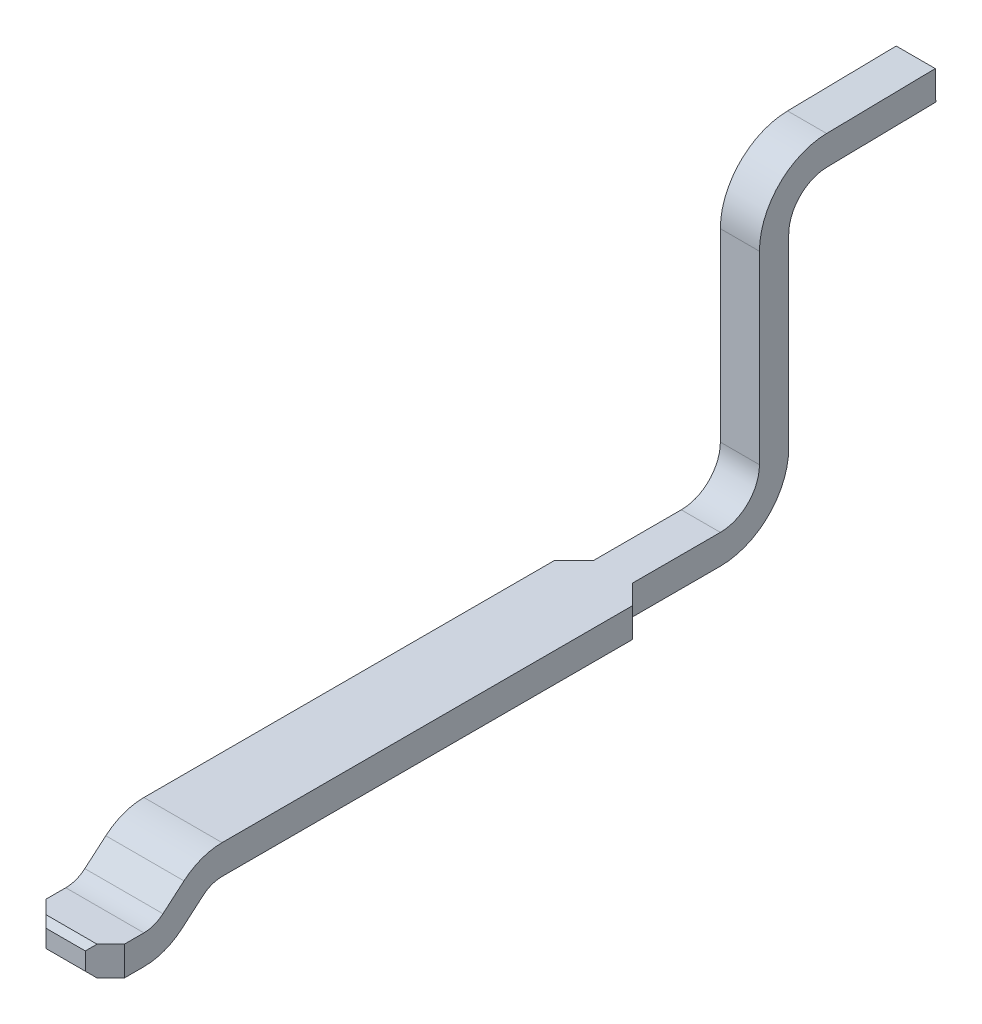
ISO-10303-21;
HEADER;
FILE_DESCRIPTION(('STEP AP214'),'2;1');
FILE_NAME('part.step','',(''),(''),'','','');
FILE_SCHEMA(('AUTOMOTIVE_DESIGN { 1 0 10303 214 1 1 1 1 }'));
ENDSEC;
DATA;
#1=APPLICATION_CONTEXT('core data for automotive mechanical design processes');
#2=APPLICATION_PROTOCOL_DEFINITION('international standard','automotive_design',2000,#1);
#3=PRODUCT_CONTEXT('',#1,'mechanical');
#4=PRODUCT('Part','Part','',(#3));
#5=PRODUCT_RELATED_PRODUCT_CATEGORY('part','',(#4));
#6=PRODUCT_DEFINITION_FORMATION('','',#4);
#7=PRODUCT_DEFINITION_CONTEXT('part definition',#1,'design');
#8=PRODUCT_DEFINITION('design','',#6,#7);
#9=PRODUCT_DEFINITION_SHAPE('','',#8);
#10=(LENGTH_UNIT() NAMED_UNIT(*) SI_UNIT(.MILLI.,.METRE.));
#11=(NAMED_UNIT(*) PLANE_ANGLE_UNIT() SI_UNIT($,.RADIAN.));
#12=(NAMED_UNIT(*) SI_UNIT($,.STERADIAN.) SOLID_ANGLE_UNIT());
#13=UNCERTAINTY_MEASURE_WITH_UNIT(LENGTH_MEASURE(1.E-05),#10,'distance_accuracy_value','');
#14=(GEOMETRIC_REPRESENTATION_CONTEXT(3) GLOBAL_UNCERTAINTY_ASSIGNED_CONTEXT((#13)) GLOBAL_UNIT_ASSIGNED_CONTEXT((#10,
#11,#12)) REPRESENTATION_CONTEXT('',''));
#15=CARTESIAN_POINT('',(0.,0.,0.));
#16=DIRECTION('',(0.,0.,1.));
#17=DIRECTION('',(1.,0.,0.));
#18=AXIS2_PLACEMENT_3D('',#15,#16,#17);
#19=CARTESIAN_POINT('',(1.85403496496787,8.074228109921,4.324047830079));
#20=DIRECTION('',(0.,0.707106781186548,0.707106781186548));
#21=DIRECTION('',(0.,-0.707106781186548,0.707106781186548));
#22=AXIS2_PLACEMENT_3D('',#19,#20,#21);
#23=PLANE('',#22);
#24=DIRECTION('',(-0.577350269189631,0.577350269189615,-0.577350269189631));
#25=VECTOR('',#24,1.);
#26=CARTESIAN_POINT('',(1.88973309999987,8.04019892,4.35807702));
#27=LINE('',#26,#25);
#28=CARTESIAN_POINT('',(1.88973309999987,8.04019892,4.35807702));
#29=VERTEX_POINT('',#28);
#30=CARTESIAN_POINT('',(1.85973309999987,8.07019892,4.32807702));
#31=VERTEX_POINT('',#30);
#32=EDGE_CURVE('E186',#29,#31,#27,.T.);
#33=ORIENTED_EDGE('',*,*,#32,.F.);
#34=DIRECTION('',(-1.,0.,0.));
#35=VECTOR('',#34,1.);
#36=CARTESIAN_POINT('',(2.09543123503187,8.04019892,4.35807702));
#37=LINE('',#36,#35);
#38=CARTESIAN_POINT('',(2.08973309999987,8.04019892,4.35807702));
#39=VERTEX_POINT('',#38);
#40=EDGE_CURVE('E179',#29,#39,#37,.F.);
#41=ORIENTED_EDGE('',*,*,#40,.T.);
#42=DIRECTION('',(-0.577350269189637,-0.577350269189604,0.577350269189637));
#43=VECTOR('',#42,1.);
#44=CARTESIAN_POINT('',(2.11973309999987,8.07019892,4.32807702));
#45=LINE('',#44,#43);
#46=CARTESIAN_POINT('',(2.11973309999987,8.07019892,4.32807702));
#47=VERTEX_POINT('',#46);
#48=EDGE_CURVE('E302',#47,#39,#45,.T.);
#49=ORIENTED_EDGE('',*,*,#48,.F.);
#50=DIRECTION('',(1.,0.,0.));
#51=VECTOR('',#50,1.);
#52=CARTESIAN_POINT('',(2.19773309999987,8.07019892,4.32807702));
#53=LINE('',#52,#51);
#54=EDGE_CURVE('E309',#31,#47,#53,.T.);
#55=ORIENTED_EDGE('',*,*,#54,.F.);
#56=EDGE_LOOP('',(#33,#41,#49,#55));
#57=FACE_BOUND('',#56,.T.);
#58=ADVANCED_FACE('F17',(#57),#23,.T.);
#59=CARTESIAN_POINT('',(2.09543123503187,7.944500784968,4.35807702));
#60=DIRECTION('',(0.,0.,-1.));
#61=DIRECTION('',(-1.,0.,0.));
#62=AXIS2_PLACEMENT_3D('',#59,#60,#61);
#63=PLANE('',#62);
#64=DIRECTION('',(0.,1.,0.));
#65=VECTOR('',#64,1.);
#66=CARTESIAN_POINT('',(2.08973309999987,7.914500784968,4.35807702));
#67=LINE('',#66,#65);
#68=CARTESIAN_POINT('',(2.08973309999987,7.95019892,4.35807702));
#69=VERTEX_POINT('',#68);
#70=EDGE_CURVE('E289',#39,#69,#67,.F.);
#71=ORIENTED_EDGE('',*,*,#70,.F.);
#72=ORIENTED_EDGE('',*,*,#40,.F.);
#73=DIRECTION('',(0.,1.,0.));
#74=VECTOR('',#73,1.);
#75=CARTESIAN_POINT('',(1.88973309999987,7.914500784968,4.35807702));
#76=LINE('',#75,#74);
#77=CARTESIAN_POINT('',(1.88973309999987,7.95019892,4.35807702));
#78=VERTEX_POINT('',#77);
#79=EDGE_CURVE('E368',#78,#29,#76,.T.);
#80=ORIENTED_EDGE('',*,*,#79,.F.);
#81=DIRECTION('',(1.,0.,0.));
#82=VECTOR('',#81,1.);
#83=CARTESIAN_POINT('',(2.12543123503187,7.95019892,4.35807702));
#84=LINE('',#83,#82);
#85=EDGE_CURVE('E359',#69,#78,#84,.F.);
#86=ORIENTED_EDGE('',*,*,#85,.F.);
#87=EDGE_LOOP('',(#71,#72,#80,#86));
#88=FACE_BOUND('',#87,.T.);
#89=ADVANCED_FACE('F778',(#88),#63,.F.);
#90=CARTESIAN_POINT('',(2.12543123503187,7.916169730079,4.324047830079));
#91=DIRECTION('',(0.,-0.707106781186548,0.707106781186548));
#92=DIRECTION('',(0.,-0.707106781186548,-0.707106781186548));
#93=AXIS2_PLACEMENT_3D('',#90,#91,#92);
#94=PLANE('',#93);
#95=DIRECTION('',(0.577350269189626,-0.577350269189626,-0.577350269189626));
#96=VECTOR('',#95,1.);
#97=CARTESIAN_POINT('',(2.08973309999987,7.95019892,4.35807702));
#98=LINE('',#97,#96);
#99=CARTESIAN_POINT('',(2.11973309999987,7.92019892,4.32807702));
#100=VERTEX_POINT('',#99);
#101=EDGE_CURVE('E303',#69,#100,#98,.T.);
#102=ORIENTED_EDGE('',*,*,#101,.F.);
#103=ORIENTED_EDGE('',*,*,#85,.T.);
#104=DIRECTION('',(0.57735026918962,0.577350269189637,0.57735026918962));
#105=VECTOR('',#104,1.);
#106=CARTESIAN_POINT('',(1.85973309999987,7.92019892,4.32807702));
#107=LINE('',#106,#105);
#108=CARTESIAN_POINT('',(1.85973309999987,7.92019892,4.32807702));
#109=VERTEX_POINT('',#108);
#110=EDGE_CURVE('E344',#109,#78,#107,.T.);
#111=ORIENTED_EDGE('',*,*,#110,.F.);
#112=DIRECTION('',(1.,0.,0.));
#113=VECTOR('',#112,1.);
#114=CARTESIAN_POINT('',(2.19773309999987,7.92019892,4.32807702));
#115=LINE('',#114,#113);
#116=EDGE_CURVE('E284',#109,#100,#115,.T.);
#117=ORIENTED_EDGE('',*,*,#116,.T.);
#118=EDGE_LOOP('',(#102,#103,#111,#117));
#119=FACE_BOUND('',#118,.T.);
#120=ADVANCED_FACE('F771',(#119),#94,.T.);
#121=CARTESIAN_POINT('',(2.09543123503187,8.45127780084181,0.758077020000001));
#122=DIRECTION('',(0.,0.,-1.));
#123=DIRECTION('',(-1.,0.,0.));
#124=AXIS2_PLACEMENT_3D('',#121,#122,#123);
#125=PLANE('',#124);
#126=DIRECTION('',(0.,1.,0.));
#127=VECTOR('',#126,1.);
#128=CARTESIAN_POINT('',(2.08973309999987,9.610333059471,0.758077020000001));
#129=LINE('',#128,#127);
#130=CARTESIAN_POINT('',(2.08973309999987,8.47019892,0.758077020000001));
#131=VERTEX_POINT('',#130);
#132=CARTESIAN_POINT('',(2.08973309999987,9.41625487791,0.758077020000001));
#133=VERTEX_POINT('',#132);
#134=EDGE_CURVE('E253',#131,#133,#129,.T.);
#135=ORIENTED_EDGE('',*,*,#134,.F.);
#136=DIRECTION('',(-1.,0.,0.));
#137=VECTOR('',#136,1.);
#138=CARTESIAN_POINT('',(2.08973309999987,8.47019892,0.75807702));
#139=LINE('',#138,#137);
#140=CARTESIAN_POINT('',(1.88973309999987,8.47019892,0.758077020000001));
#141=VERTEX_POINT('',#140);
#142=EDGE_CURVE('E361',#141,#131,#139,.F.);
#143=ORIENTED_EDGE('',*,*,#142,.F.);
#144=DIRECTION('',(0.,1.,0.));
#145=VECTOR('',#144,1.);
#146=CARTESIAN_POINT('',(1.88973309999987,8.45127780084181,0.758077020000001));
#147=LINE('',#146,#145);
#148=CARTESIAN_POINT('',(1.88973309999987,9.41625487791,0.758077020000001));
#149=VERTEX_POINT('',#148);
#150=EDGE_CURVE('E235',#149,#141,#147,.F.);
#151=ORIENTED_EDGE('',*,*,#150,.F.);
#152=DIRECTION('',(1.,0.,0.));
#153=VECTOR('',#152,1.);
#154=CARTESIAN_POINT('',(1.88973309999987,9.41625487791,0.758077020000001));
#155=LINE('',#154,#153);
#156=EDGE_CURVE('E342',#149,#133,#155,.T.);
#157=ORIENTED_EDGE('',*,*,#156,.T.);
#158=EDGE_LOOP('',(#135,#143,#151,#157));
#159=FACE_BOUND('',#158,.T.);
#160=ADVANCED_FACE('F474',(#159),#125,.T.);
#161=CARTESIAN_POINT('',(2.08973309999987,8.47019892,1.10807702));
#162=DIRECTION('',(-1.,0.,0.));
#163=DIRECTION('',(0.,0.,1.));
#164=AXIS2_PLACEMENT_3D('',#161,#162,#163);
#165=CYLINDRICAL_SURFACE('',#164,0.2);
#166=DIRECTION('',(1.,0.,0.));
#167=VECTOR('',#166,1.);
#168=CARTESIAN_POINT('',(2.19773309999987,8.27019892,1.10807702));
#169=LINE('',#168,#167);
#170=CARTESIAN_POINT('',(2.08973309999987,8.27019892,1.10807702));
#171=VERTEX_POINT('',#170);
#172=CARTESIAN_POINT('',(1.88973309999987,8.27019892,1.10807702));
#173=VERTEX_POINT('',#172);
#174=EDGE_CURVE('E317',#171,#173,#169,.F.);
#175=ORIENTED_EDGE('',*,*,#174,.F.);
#176=CARTESIAN_POINT('',(2.08973309999987,8.47019892,1.10807702));
#177=DIRECTION('',(-1.,0.,0.));
#178=DIRECTION('',(0.,0.,1.));
#179=AXIS2_PLACEMENT_3D('',#176,#177,#178);
#180=CIRCLE('',#179,0.2);
#181=CARTESIAN_POINT('',(2.08973309999987,8.47019892,0.908077020000001));
#182=VERTEX_POINT('',#181);
#183=EDGE_CURVE('E259',#182,#171,#180,.T.);
#184=ORIENTED_EDGE('',*,*,#183,.F.);
#185=DIRECTION('',(-1.,0.,0.));
#186=VECTOR('',#185,1.);
#187=CARTESIAN_POINT('',(2.09543123503187,8.47019892,0.908077020000001));
#188=LINE('',#187,#186);
#189=CARTESIAN_POINT('',(1.88973309999987,8.47019892,0.908077020000001));
#190=VERTEX_POINT('',#189);
#191=EDGE_CURVE('E356',#182,#190,#188,.T.);
#192=ORIENTED_EDGE('',*,*,#191,.T.);
#193=CARTESIAN_POINT('',(1.88973309999987,8.47019892,1.10807702));
#194=DIRECTION('',(-1.,0.,0.));
#195=DIRECTION('',(0.,0.,1.));
#196=AXIS2_PLACEMENT_3D('',#193,#194,#195);
#197=CIRCLE('',#196,0.2);
#198=EDGE_CURVE('E228',#173,#190,#197,.F.);
#199=ORIENTED_EDGE('',*,*,#198,.F.);
#200=EDGE_LOOP('',(#175,#184,#192,#199));
#201=FACE_BOUND('',#200,.T.);
#202=ADVANCED_FACE('F441',(#201),#165,.F.);
#203=CARTESIAN_POINT('',(2.09543123503187,8.45127780084181,0.908077020000001));
#204=DIRECTION('',(0.,0.,-1.));
#205=DIRECTION('',(-1.,0.,0.));
#206=AXIS2_PLACEMENT_3D('',#203,#204,#205);
#207=PLANE('',#206);
#208=ORIENTED_EDGE('',*,*,#191,.F.);
#209=DIRECTION('',(0.,1.,0.));
#210=VECTOR('',#209,1.);
#211=CARTESIAN_POINT('',(2.08973309999987,9.610333059471,0.908077020000001));
#212=LINE('',#211,#210);
#213=CARTESIAN_POINT('',(2.08973309999987,9.41625487791,0.908077020000001));
#214=VERTEX_POINT('',#213);
#215=EDGE_CURVE('E262',#214,#182,#212,.F.);
#216=ORIENTED_EDGE('',*,*,#215,.F.);
#217=DIRECTION('',(1.,0.,0.));
#218=VECTOR('',#217,1.);
#219=CARTESIAN_POINT('',(1.88973309999987,9.41625487791,0.908077020000001));
#220=LINE('',#219,#218);
#221=CARTESIAN_POINT('',(1.88973309999987,9.41625487791,0.908077020000001));
#222=VERTEX_POINT('',#221);
#223=EDGE_CURVE('E354',#222,#214,#220,.T.);
#224=ORIENTED_EDGE('',*,*,#223,.F.);
#225=DIRECTION('',(0.,1.,0.));
#226=VECTOR('',#225,1.);
#227=CARTESIAN_POINT('',(1.88973309999987,8.45127780084181,0.908077020000001));
#228=LINE('',#227,#226);
#229=EDGE_CURVE('E226',#190,#222,#228,.T.);
#230=ORIENTED_EDGE('',*,*,#229,.F.);
#231=EDGE_LOOP('',(#208,#216,#224,#230));
#232=FACE_BOUND('',#231,.T.);
#233=ADVANCED_FACE('F750',(#232),#207,.F.);
#234=CARTESIAN_POINT('',(1.88973309999987,9.41625487791,0.558077020000001));
#235=DIRECTION('',(1.,0.,0.));
#236=DIRECTION('',(0.,0.,-1.));
#237=AXIS2_PLACEMENT_3D('',#234,#235,#236);
#238=CYLINDRICAL_SURFACE('',#237,0.35);
#239=ORIENTED_EDGE('',*,*,#223,.T.);
#240=CARTESIAN_POINT('',(2.08973309999987,9.41625487791,0.558077020000001));
#241=DIRECTION('',(1.,0.,0.));
#242=DIRECTION('',(0.,0.,-1.));
#243=AXIS2_PLACEMENT_3D('',#240,#241,#242);
#244=CIRCLE('',#243,0.35);
#245=CARTESIAN_POINT('',(2.08973309999987,9.76620157121429,0.564185362253241));
#246=VERTEX_POINT('',#245);
#247=EDGE_CURVE('E20',#246,#214,#244,.T.);
#248=ORIENTED_EDGE('',*,*,#247,.F.);
#249=DIRECTION('',(1.,0.,0.));
#250=VECTOR('',#249,1.);
#251=CARTESIAN_POINT('',(1.88403496496787,9.76620157121458,0.564185362253011));
#252=LINE('',#251,#250);
#253=CARTESIAN_POINT('',(1.88973309999987,9.76620157121429,0.564185362253241));
#254=VERTEX_POINT('',#253);
#255=EDGE_CURVE('E143',#254,#246,#252,.T.);
#256=ORIENTED_EDGE('',*,*,#255,.F.);
#257=CARTESIAN_POINT('',(1.88973309999987,9.41625487791,0.558077020000001));
#258=DIRECTION('',(1.,0.,0.));
#259=DIRECTION('',(0.,0.,-1.));
#260=AXIS2_PLACEMENT_3D('',#257,#258,#259);
#261=CIRCLE('',#260,0.35);
#262=EDGE_CURVE('E223',#222,#254,#261,.F.);
#263=ORIENTED_EDGE('',*,*,#262,.F.);
#264=EDGE_LOOP('',(#239,#248,#256,#263));
#265=FACE_BOUND('',#264,.T.);
#266=ADVANCED_FACE('F743',(#265),#238,.T.);
#267=CARTESIAN_POINT('',(1.88403496496787,9.766007480923,0.575304787611001));
#268=DIRECTION('',(0.,0.999847695156406,0.0174524064364471));
#269=DIRECTION('',(0.,-0.0174524064364471,0.999847695156406));
#270=AXIS2_PLACEMENT_3D('',#267,#268,#269);
#271=PLANE('',#270);
#272=DIRECTION('',(0.,0.0174524064385203,-0.99984769515637));
#273=VECTOR('',#272,1.);
#274=CARTESIAN_POINT('',(1.88973309999987,9.766201571214,0.564185362253001));
#275=LINE('',#274,#273);
#276=CARTESIAN_POINT('',(1.88973309999987,9.775906085794,0.00821409435916126));
#277=VERTEX_POINT('',#276);
#278=EDGE_CURVE('E199',#254,#277,#275,.T.);
#279=ORIENTED_EDGE('',*,*,#278,.F.);
#280=ORIENTED_EDGE('',*,*,#255,.T.);
#281=DIRECTION('',(0.,-0.0174524064385203,0.99984769515637));
#282=VECTOR('',#281,1.);
#283=CARTESIAN_POINT('',(2.08973309999987,9.775906085794,0.00821409435900074));
#284=LINE('',#283,#282);
#285=CARTESIAN_POINT('',(2.08973309999987,9.775906085794,0.00821409435916126));
#286=VERTEX_POINT('',#285);
#287=EDGE_CURVE('E265',#286,#246,#284,.T.);
#288=ORIENTED_EDGE('',*,*,#287,.F.);
#289=DIRECTION('',(1.,0.,0.));
#290=VECTOR('',#289,1.);
#291=CARTESIAN_POINT('',(2.09543123503187,9.77590608579399,0.0082140943594823));
#292=LINE('',#291,#290);
#293=EDGE_CURVE('E153',#277,#286,#292,.T.);
#294=ORIENTED_EDGE('',*,*,#293,.F.);
#295=EDGE_LOOP('',(#279,#280,#288,#294));
#296=FACE_BOUND('',#295,.T.);
#297=ADVANCED_FACE('F736',(#296),#271,.T.);
#298=CARTESIAN_POINT('',(2.09543123503187,9.620231664342,0.00549678722500089));
#299=DIRECTION('',(0.,0.0174524064396861,-0.999847695156349));
#300=DIRECTION('',(0.,0.999847695156349,0.0174524064396861));
#301=AXIS2_PLACEMENT_3D('',#298,#299,#300);
#302=PLANE('',#301);
#303=DIRECTION('',(1.,0.,0.));
#304=VECTOR('',#303,1.);
#305=CARTESIAN_POINT('',(1.88403496496787,9.62592893152041,0.00559623339400797));
#306=LINE('',#305,#304);
#307=CARTESIAN_POINT('',(2.08973309999987,9.62592893152018,0.00559623339400417));
#308=VERTEX_POINT('',#307);
#309=CARTESIAN_POINT('',(1.88973309999987,9.62592893152014,0.00559623339400334));
#310=VERTEX_POINT('',#309);
#311=EDGE_CURVE('E202',#308,#310,#306,.F.);
#312=ORIENTED_EDGE('',*,*,#311,.T.);
#313=DIRECTION('',(0.,-0.999847695156461,-0.0174524064332696));
#314=VECTOR('',#313,1.);
#315=CARTESIAN_POINT('',(1.88973309999987,9.775906085794,0.00821409435900074));
#316=LINE('',#315,#314);
#317=EDGE_CURVE('E192',#277,#310,#316,.T.);
#318=ORIENTED_EDGE('',*,*,#317,.F.);
#319=ORIENTED_EDGE('',*,*,#293,.T.);
#320=DIRECTION('',(0.,0.999847695156461,0.0174524064332696));
#321=VECTOR('',#320,1.);
#322=CARTESIAN_POINT('',(2.08973309999987,9.62592893152,0.00559623339400103));
#323=LINE('',#322,#321);
#324=EDGE_CURVE('E204',#308,#286,#323,.T.);
#325=ORIENTED_EDGE('',*,*,#324,.F.);
#326=EDGE_LOOP('',(#312,#318,#319,#325));
#327=FACE_BOUND('',#326,.T.);
#328=ADVANCED_FACE('F203',(#327),#302,.T.);
#329=CARTESIAN_POINT('',(1.88403496496787,9.616030326649,0.572686926645001));
#330=DIRECTION('',(0.,0.999847695156375,0.0174524064382066));
#331=DIRECTION('',(0.,-0.0174524064382066,0.999847695156375));
#332=AXIS2_PLACEMENT_3D('',#329,#330,#331);
#333=PLANE('',#332);
#334=DIRECTION('',(1.,0.,0.));
#335=VECTOR('',#334,1.);
#336=CARTESIAN_POINT('',(1.88973309999987,9.61622441694128,0.561567501287006));
#337=LINE('',#336,#335);
#338=CARTESIAN_POINT('',(2.08973309999987,9.61622441694114,0.561567501287176));
#339=VERTEX_POINT('',#338);
#340=CARTESIAN_POINT('',(1.88973309999987,9.61622441694114,0.561567501287176));
#341=VERTEX_POINT('',#340);
#342=EDGE_CURVE('E208',#339,#341,#337,.F.);
#343=ORIENTED_EDGE('',*,*,#342,.T.);
#344=DIRECTION('',(0.,-0.0174524064367521,0.999847695156401));
#345=VECTOR('',#344,1.);
#346=CARTESIAN_POINT('',(1.88973309999987,9.62592893152,0.00559623339400103));
#347=LINE('',#346,#345);
#348=EDGE_CURVE('E197',#310,#341,#347,.T.);
#349=ORIENTED_EDGE('',*,*,#348,.F.);
#350=ORIENTED_EDGE('',*,*,#311,.F.);
#351=DIRECTION('',(0.,0.0174524064367521,-0.999847695156401));
#352=VECTOR('',#351,1.);
#353=CARTESIAN_POINT('',(2.08973309999987,9.616224416941,0.561567501287001));
#354=LINE('',#353,#352);
#355=EDGE_CURVE('E248',#339,#308,#354,.T.);
#356=ORIENTED_EDGE('',*,*,#355,.F.);
#357=EDGE_LOOP('',(#343,#349,#350,#356));
#358=FACE_BOUND('',#357,.T.);
#359=ADVANCED_FACE('F210',(#358),#333,.F.);
#360=CARTESIAN_POINT('',(1.88973309999987,9.41625487791,0.558077020000001));
#361=DIRECTION('',(1.,0.,0.));
#362=DIRECTION('',(0.,0.,-1.));
#363=AXIS2_PLACEMENT_3D('',#360,#361,#362);
#364=CYLINDRICAL_SURFACE('',#363,0.2);
#365=ORIENTED_EDGE('',*,*,#156,.F.);
#366=CARTESIAN_POINT('',(1.88973309999987,9.41625487791,0.558077020000001));
#367=DIRECTION('',(1.,0.,0.));
#368=DIRECTION('',(0.,0.,-1.));
#369=AXIS2_PLACEMENT_3D('',#366,#367,#368);
#370=CIRCLE('',#369,0.2);
#371=EDGE_CURVE('E212',#341,#149,#370,.T.);
#372=ORIENTED_EDGE('',*,*,#371,.F.);
#373=ORIENTED_EDGE('',*,*,#342,.F.);
#374=CARTESIAN_POINT('',(2.08973309999987,9.41625487791,0.558077020000001));
#375=DIRECTION('',(1.,0.,0.));
#376=DIRECTION('',(0.,0.,-1.));
#377=AXIS2_PLACEMENT_3D('',#374,#375,#376);
#378=CIRCLE('',#377,0.2);
#379=EDGE_CURVE('E250',#133,#339,#378,.F.);
#380=ORIENTED_EDGE('',*,*,#379,.F.);
#381=EDGE_LOOP('',(#365,#372,#373,#380));
#382=FACE_BOUND('',#381,.T.);
#383=ADVANCED_FACE('F476',(#382),#364,.F.);
#384=CARTESIAN_POINT('',(1.78570391007887,7.914500784968,4.254047830079));
#385=DIRECTION('',(-0.707106781186548,0.,0.707106781186548));
#386=DIRECTION('',(0.707106781186548,0.,0.707106781186548));
#387=AXIS2_PLACEMENT_3D('',#384,#385,#386);
#388=PLANE('',#387);
#389=DIRECTION('',(0.,1.,0.));
#390=VECTOR('',#389,1.);
#391=CARTESIAN_POINT('',(1.78973309999987,7.914500784968,4.25807702));
#392=LINE('',#391,#390);
#393=CARTESIAN_POINT('',(1.78973309999987,8.07019892,4.25807702));
#394=VERTEX_POINT('',#393);
#395=CARTESIAN_POINT('',(1.78973309999987,7.92019892,4.25807702));
#396=VERTEX_POINT('',#395);
#397=EDGE_CURVE('E332',#394,#396,#392,.F.);
#398=ORIENTED_EDGE('',*,*,#397,.T.);
#399=DIRECTION('',(0.707106781186544,0.,0.707106781186551));
#400=VECTOR('',#399,1.);
#401=CARTESIAN_POINT('',(1.78973309999987,7.92019892,4.25807702));
#402=LINE('',#401,#400);
#403=EDGE_CURVE('E288',#396,#109,#402,.T.);
#404=ORIENTED_EDGE('',*,*,#403,.T.);
#405=ORIENTED_EDGE('',*,*,#110,.T.);
#406=ORIENTED_EDGE('',*,*,#79,.T.);
#407=ORIENTED_EDGE('',*,*,#32,.T.);
#408=DIRECTION('',(0.707106781186544,0.,0.707106781186551));
#409=VECTOR('',#408,1.);
#410=CARTESIAN_POINT('',(1.78973309999987,8.07019892,4.25807702));
#411=LINE('',#410,#409);
#412=EDGE_CURVE('E308',#394,#31,#411,.T.);
#413=ORIENTED_EDGE('',*,*,#412,.F.);
#414=EDGE_LOOP('',(#398,#404,#405,#406,#407,#413));
#415=FACE_BOUND('',#414,.T.);
#416=ADVANCED_FACE('F565',(#415),#388,.T.);
#417=CARTESIAN_POINT('',(2.19773309999987,8.27019892,3.81107702));
#418=DIRECTION('',(0.,1.,0.));
#419=DIRECTION('',(0.,0.,1.));
#420=AXIS2_PLACEMENT_3D('',#417,#418,#419);
#421=PLANE('',#420);
#422=DIRECTION('',(0.,0.,-1.));
#423=VECTOR('',#422,1.);
#424=CARTESIAN_POINT('',(2.18973309999987,8.27019892,3.80007702));
#425=LINE('',#424,#423);
#426=CARTESIAN_POINT('',(2.18973309999987,8.27019892,1.65807702));
#427=VERTEX_POINT('',#426);
#428=CARTESIAN_POINT('',(2.18973309999987,8.27019892,3.75807702));
#429=VERTEX_POINT('',#428);
#430=EDGE_CURVE('E411',#427,#429,#425,.F.);
#431=ORIENTED_EDGE('',*,*,#430,.F.);
#432=DIRECTION('',(-0.707106781186548,0.,-0.707106781186548));
#433=VECTOR('',#432,1.);
#434=CARTESIAN_POINT('',(2.08570391007887,8.27019892,1.554047830079));
#435=LINE('',#434,#433);
#436=CARTESIAN_POINT('',(2.08973309999987,8.27019892,1.55807702));
#437=VERTEX_POINT('',#436);
#438=EDGE_CURVE('E267',#437,#427,#435,.F.);
#439=ORIENTED_EDGE('',*,*,#438,.F.);
#440=DIRECTION('',(0.,0.,-1.));
#441=VECTOR('',#440,1.);
#442=CARTESIAN_POINT('',(2.08973309999987,8.27019892,0.572587480477));
#443=LINE('',#442,#441);
#444=EDGE_CURVE('E256',#171,#437,#443,.F.);
#445=ORIENTED_EDGE('',*,*,#444,.F.);
#446=ORIENTED_EDGE('',*,*,#174,.T.);
#447=DIRECTION('',(0.,0.,1.));
#448=VECTOR('',#447,1.);
#449=CARTESIAN_POINT('',(1.88973309999987,8.27019892,0.913775155032));
#450=LINE('',#449,#448);
#451=CARTESIAN_POINT('',(1.88973309999987,8.27019892,1.55807702));
#452=VERTEX_POINT('',#451);
#453=EDGE_CURVE('E229',#452,#173,#450,.F.);
#454=ORIENTED_EDGE('',*,*,#453,.F.);
#455=DIRECTION('',(-0.707106781186548,0.,0.707106781186548));
#456=VECTOR('',#455,1.);
#457=CARTESIAN_POINT('',(1.78570391007887,8.27019892,1.662106209921));
#458=LINE('',#457,#456);
#459=CARTESIAN_POINT('',(1.78973309999987,8.27019892,1.65807702));
#460=VERTEX_POINT('',#459);
#461=EDGE_CURVE('E322',#460,#452,#458,.F.);
#462=ORIENTED_EDGE('',*,*,#461,.F.);
#463=DIRECTION('',(0.,0.,-1.));
#464=VECTOR('',#463,1.);
#465=CARTESIAN_POINT('',(1.78973309999987,8.27019892,4.163775155032));
#466=LINE('',#465,#464);
#467=CARTESIAN_POINT('',(1.78973309999987,8.27019892,3.75807702));
#468=VERTEX_POINT('',#467);
#469=EDGE_CURVE('E421',#460,#468,#466,.F.);
#470=ORIENTED_EDGE('',*,*,#469,.T.);
#471=DIRECTION('',(-1.,0.,0.));
#472=VECTOR('',#471,1.);
#473=CARTESIAN_POINT('',(2.18973309999987,8.27019892,3.75807702));
#474=LINE('',#473,#472);
#475=EDGE_CURVE('E315',#429,#468,#474,.T.);
#476=ORIENTED_EDGE('',*,*,#475,.F.);
#477=EDGE_LOOP('',(#431,#439,#445,#446,#454,#462,#470,#476));
#478=FACE_BOUND('',#477,.T.);
#479=ADVANCED_FACE('F445',(#478),#421,.T.);
#480=CARTESIAN_POINT('',(2.18973309999987,7.97019892,3.75807702));
#481=DIRECTION('',(-1.,0.,0.));
#482=DIRECTION('',(0.,0.,1.));
#483=AXIS2_PLACEMENT_3D('',#480,#481,#482);
#484=CYLINDRICAL_SURFACE('',#483,0.3);
#485=CARTESIAN_POINT('',(1.78973309999987,7.97019892,3.75807702));
#486=DIRECTION('',(-1.,0.,0.));
#487=DIRECTION('',(0.,0.,1.));
#488=AXIS2_PLACEMENT_3D('',#485,#486,#487);
#489=CIRCLE('',#488,0.3);
#490=CARTESIAN_POINT('',(1.78973309999987,8.19815650538647,3.9531035291326));
#491=VERTEX_POINT('',#490);
#492=EDGE_CURVE('E418',#468,#491,#489,.F.);
#493=ORIENTED_EDGE('',*,*,#492,.T.);
#494=DIRECTION('',(1.,0.,0.));
#495=VECTOR('',#494,1.);
#496=CARTESIAN_POINT('',(2.19773309999987,8.19815650538616,3.95310352913313));
#497=LINE('',#496,#495);
#498=CARTESIAN_POINT('',(2.18973309999987,8.19815650538647,3.9531035291326));
#499=VERTEX_POINT('',#498);
#500=EDGE_CURVE('E313',#499,#491,#497,.F.);
#501=ORIENTED_EDGE('',*,*,#500,.F.);
#502=CARTESIAN_POINT('',(2.18973309999987,7.97019892,3.75807702));
#503=DIRECTION('',(-1.,0.,0.));
#504=DIRECTION('',(0.,0.,1.));
#505=AXIS2_PLACEMENT_3D('',#502,#503,#504);
#506=CIRCLE('',#505,0.3);
#507=EDGE_CURVE('E409',#429,#499,#506,.F.);
#508=ORIENTED_EDGE('',*,*,#507,.F.);
#509=ORIENTED_EDGE('',*,*,#475,.T.);
#510=EDGE_LOOP('',(#493,#501,#508,#509));
#511=FACE_BOUND('',#510,.T.);
#512=ADVANCED_FACE('F585',(#511),#484,.T.);
#513=CARTESIAN_POINT('',(2.19773309999987,8.102515836027,4.064893542443));
#514=DIRECTION('',(0.,0.759858617954068,0.650088363779058));
#515=DIRECTION('',(0.,-0.650088363779058,0.759858617954068));
#516=AXIS2_PLACEMENT_3D('',#513,#514,#515);
#517=PLANE('',#516);
#518=DIRECTION('',(0.,-0.650088363774947,0.759858617957586));
#519=VECTOR('',#518,1.);
#520=CARTESIAN_POINT('',(1.78973309999987,8.198156505386,3.953103529133));
#521=LINE('',#520,#519);
#522=CARTESIAN_POINT('',(1.78973309999987,8.10622012730668,4.06056376543338));
#523=VERTEX_POINT('',#522);
#524=EDGE_CURVE('E417',#491,#523,#521,.T.);
#525=ORIENTED_EDGE('',*,*,#524,.T.);
#526=DIRECTION('',(-1.,0.,0.));
#527=VECTOR('',#526,1.);
#528=CARTESIAN_POINT('',(2.18973309999987,8.10622012730701,4.06056376543301));
#529=LINE('',#528,#527);
#530=CARTESIAN_POINT('',(2.18973309999987,8.10622012730668,4.06056376543338));
#531=VERTEX_POINT('',#530);
#532=EDGE_CURVE('E310',#523,#531,#529,.F.);
#533=ORIENTED_EDGE('',*,*,#532,.T.);
#534=DIRECTION('',(0.,-0.650088363774947,0.759858617957586));
#535=VECTOR('',#534,1.);
#536=CARTESIAN_POINT('',(2.18973309999987,8.198156505386,3.953103529133));
#537=LINE('',#536,#535);
#538=EDGE_CURVE('E408',#499,#531,#537,.T.);
#539=ORIENTED_EDGE('',*,*,#538,.F.);
#540=ORIENTED_EDGE('',*,*,#500,.T.);
#541=EDGE_LOOP('',(#525,#533,#539,#540));
#542=FACE_BOUND('',#541,.T.);
#543=ADVANCED_FACE('F580',(#542),#517,.T.);
#544=CARTESIAN_POINT('',(2.18973309999987,8.22019892,4.15807702));
#545=DIRECTION('',(-1.,0.,0.));
#546=DIRECTION('',(0.,0.,1.));
#547=AXIS2_PLACEMENT_3D('',#544,#545,#546);
#548=CYLINDRICAL_SURFACE('',#547,0.15);
#549=CARTESIAN_POINT('',(1.78973309999987,8.22019892,4.15807702));
#550=DIRECTION('',(-1.,0.,0.));
#551=DIRECTION('',(0.,0.,1.));
#552=AXIS2_PLACEMENT_3D('',#549,#550,#551);
#553=CIRCLE('',#552,0.15);
#554=CARTESIAN_POINT('',(1.78973309999987,8.07019892,4.15807702));
#555=VERTEX_POINT('',#554);
#556=EDGE_CURVE('E414',#523,#555,#553,.T.);
#557=ORIENTED_EDGE('',*,*,#556,.T.);
#558=DIRECTION('',(1.,0.,0.));
#559=VECTOR('',#558,1.);
#560=CARTESIAN_POINT('',(2.19773309999987,8.07019892,4.15807702));
#561=LINE('',#560,#559);
#562=CARTESIAN_POINT('',(2.18973309999987,8.07019892,4.15807702));
#563=VERTEX_POINT('',#562);
#564=EDGE_CURVE('E306',#563,#555,#561,.F.);
#565=ORIENTED_EDGE('',*,*,#564,.F.);
#566=CARTESIAN_POINT('',(2.18973309999987,8.22019892,4.15807702));
#567=DIRECTION('',(-1.,0.,0.));
#568=DIRECTION('',(0.,0.,1.));
#569=AXIS2_PLACEMENT_3D('',#566,#567,#568);
#570=CIRCLE('',#569,0.15);
#571=EDGE_CURVE('E406',#531,#563,#570,.T.);
#572=ORIENTED_EDGE('',*,*,#571,.F.);
#573=ORIENTED_EDGE('',*,*,#532,.F.);
#574=EDGE_LOOP('',(#557,#565,#572,#573));
#575=FACE_BOUND('',#574,.T.);
#576=ADVANCED_FACE('F578',(#575),#548,.F.);
#577=CARTESIAN_POINT('',(2.19773309999987,8.07019892,4.333775155032));
#578=DIRECTION('',(0.,1.,0.));
#579=DIRECTION('',(0.,0.,1.));
#580=AXIS2_PLACEMENT_3D('',#577,#578,#579);
#581=PLANE('',#580);
#582=DIRECTION('',(0.,0.,-1.));
#583=VECTOR('',#582,1.);
#584=CARTESIAN_POINT('',(1.78973309999987,8.07019892,4.163775155032));
#585=LINE('',#584,#583);
#586=EDGE_CURVE('E325',#555,#394,#585,.F.);
#587=ORIENTED_EDGE('',*,*,#586,.T.);
#588=ORIENTED_EDGE('',*,*,#412,.T.);
#589=ORIENTED_EDGE('',*,*,#54,.T.);
#590=DIRECTION('',(0.707106781186548,0.,-0.707106781186548));
#591=VECTOR('',#590,1.);
#592=CARTESIAN_POINT('',(2.08570391007887,8.07019892,4.362106209921));
#593=LINE('',#592,#591);
#594=CARTESIAN_POINT('',(2.18973309999987,8.07019892,4.25807702));
#595=VERTEX_POINT('',#594);
#596=EDGE_CURVE('E299',#595,#47,#593,.F.);
#597=ORIENTED_EDGE('',*,*,#596,.F.);
#598=DIRECTION('',(0.,0.,-1.));
#599=VECTOR('',#598,1.);
#600=CARTESIAN_POINT('',(2.18973309999987,8.07019892,3.80007702));
#601=LINE('',#600,#599);
#602=EDGE_CURVE('E296',#563,#595,#601,.F.);
#603=ORIENTED_EDGE('',*,*,#602,.F.);
#604=ORIENTED_EDGE('',*,*,#564,.T.);
#605=EDGE_LOOP('',(#587,#588,#589,#597,#603,#604));
#606=FACE_BOUND('',#605,.T.);
#607=ADVANCED_FACE('F572',(#606),#581,.T.);
#608=CARTESIAN_POINT('',(2.08570391007887,7.914500784968,4.362106209921));
#609=DIRECTION('',(0.707106781186548,0.,0.707106781186548));
#610=DIRECTION('',(0.707106781186548,0.,-0.707106781186548));
#611=AXIS2_PLACEMENT_3D('',#608,#609,#610);
#612=PLANE('',#611);
#613=ORIENTED_EDGE('',*,*,#48,.T.);
#614=ORIENTED_EDGE('',*,*,#70,.T.);
#615=ORIENTED_EDGE('',*,*,#101,.T.);
#616=DIRECTION('',(0.707106781186545,0.,-0.70710678118655));
#617=VECTOR('',#616,1.);
#618=CARTESIAN_POINT('',(2.11973309999987,7.92019892,4.32807702));
#619=LINE('',#618,#617);
#620=CARTESIAN_POINT('',(2.18973309999987,7.92019892,4.25807702));
#621=VERTEX_POINT('',#620);
#622=EDGE_CURVE('E285',#100,#621,#619,.T.);
#623=ORIENTED_EDGE('',*,*,#622,.T.);
#624=DIRECTION('',(0.,1.,0.));
#625=VECTOR('',#624,1.);
#626=CARTESIAN_POINT('',(2.18973309999987,8.114500784968,4.25807702));
#627=LINE('',#626,#625);
#628=EDGE_CURVE('E292',#595,#621,#627,.F.);
#629=ORIENTED_EDGE('',*,*,#628,.F.);
#630=ORIENTED_EDGE('',*,*,#596,.T.);
#631=EDGE_LOOP('',(#613,#614,#615,#623,#629,#630));
#632=FACE_BOUND('',#631,.T.);
#633=ADVANCED_FACE('F589',(#632),#612,.T.);
#634=CARTESIAN_POINT('',(2.19773309999987,7.92019892,4.333775155032));
#635=DIRECTION('',(0.,1.,0.));
#636=DIRECTION('',(0.,0.,1.));
#637=AXIS2_PLACEMENT_3D('',#634,#635,#636);
#638=PLANE('',#637);
#639=ORIENTED_EDGE('',*,*,#403,.F.);
#640=DIRECTION('',(0.,0.,-1.));
#641=VECTOR('',#640,1.);
#642=CARTESIAN_POINT('',(1.78973309999987,7.92019892,4.163775155032));
#643=LINE('',#642,#641);
#644=CARTESIAN_POINT('',(1.78973309999987,7.92019892,4.15807702));
#645=VERTEX_POINT('',#644);
#646=EDGE_CURVE('E335',#396,#645,#643,.T.);
#647=ORIENTED_EDGE('',*,*,#646,.T.);
#648=DIRECTION('',(-1.,0.,0.));
#649=VECTOR('',#648,1.);
#650=CARTESIAN_POINT('',(2.18973309999987,7.92019892,4.15807702));
#651=LINE('',#650,#649);
#652=CARTESIAN_POINT('',(2.18973309999987,7.92019892,4.15807702));
#653=VERTEX_POINT('',#652);
#654=EDGE_CURVE('E282',#653,#645,#651,.T.);
#655=ORIENTED_EDGE('',*,*,#654,.F.);
#656=DIRECTION('',(0.,0.,-1.));
#657=VECTOR('',#656,1.);
#658=CARTESIAN_POINT('',(2.18973309999987,7.92019892,3.80007702));
#659=LINE('',#658,#657);
#660=EDGE_CURVE('E295',#621,#653,#659,.T.);
#661=ORIENTED_EDGE('',*,*,#660,.F.);
#662=ORIENTED_EDGE('',*,*,#622,.F.);
#663=ORIENTED_EDGE('',*,*,#116,.F.);
#664=EDGE_LOOP('',(#639,#647,#655,#661,#662,#663));
#665=FACE_BOUND('',#664,.T.);
#666=ADVANCED_FACE('F596',(#665),#638,.F.);
#667=CARTESIAN_POINT('',(2.18973309999987,8.22019892,4.15807702));
#668=DIRECTION('',(-1.,0.,0.));
#669=DIRECTION('',(0.,0.,1.));
#670=AXIS2_PLACEMENT_3D('',#667,#668,#669);
#671=CYLINDRICAL_SURFACE('',#670,0.3);
#672=CARTESIAN_POINT('',(1.78973309999987,8.22019892,4.15807702));
#673=DIRECTION('',(-1.,0.,0.));
#674=DIRECTION('',(0.,0.,1.));
#675=AXIS2_PLACEMENT_3D('',#672,#673,#674);
#676=CIRCLE('',#675,0.3);
#677=CARTESIAN_POINT('',(1.78973309999987,7.99224133461339,3.96305051086728));
#678=VERTEX_POINT('',#677);
#679=EDGE_CURVE('E422',#645,#678,#676,.F.);
#680=ORIENTED_EDGE('',*,*,#679,.T.);
#681=DIRECTION('',(1.,0.,0.));
#682=VECTOR('',#681,1.);
#683=CARTESIAN_POINT('',(2.19773309999987,7.99224133461357,3.96305051086664));
#684=LINE('',#683,#682);
#685=CARTESIAN_POINT('',(2.18973309999987,7.99224133461339,3.96305051086728));
#686=VERTEX_POINT('',#685);
#687=EDGE_CURVE('E279',#678,#686,#684,.T.);
#688=ORIENTED_EDGE('',*,*,#687,.T.);
#689=CARTESIAN_POINT('',(2.18973309999987,8.22019892,4.15807702));
#690=DIRECTION('',(-1.,0.,0.));
#691=DIRECTION('',(0.,0.,1.));
#692=AXIS2_PLACEMENT_3D('',#689,#690,#691);
#693=CIRCLE('',#692,0.3);
#694=EDGE_CURVE('E404',#653,#686,#693,.F.);
#695=ORIENTED_EDGE('',*,*,#694,.F.);
#696=ORIENTED_EDGE('',*,*,#654,.T.);
#697=EDGE_LOOP('',(#680,#688,#695,#696));
#698=FACE_BOUND('',#697,.T.);
#699=ADVANCED_FACE('F598',(#698),#671,.T.);
#700=CARTESIAN_POINT('',(2.19773309999987,7.988537043334,3.967380287877));
#701=DIRECTION('',(0.,0.759858617954068,0.650088363779058));
#702=DIRECTION('',(0.,-0.650088363779058,0.759858617954068));
#703=AXIS2_PLACEMENT_3D('',#700,#701,#702);
#704=PLANE('',#703);
#705=ORIENTED_EDGE('',*,*,#687,.F.);
#706=DIRECTION('',(0.,0.650088363774937,-0.759858617957595));
#707=VECTOR('',#706,1.);
#708=CARTESIAN_POINT('',(1.78973309999987,7.992241334614,3.963050510867));
#709=LINE('',#708,#707);
#710=CARTESIAN_POINT('',(1.78973309999987,8.08417771269332,3.85559027456662));
#711=VERTEX_POINT('',#710);
#712=EDGE_CURVE('E424',#678,#711,#709,.T.);
#713=ORIENTED_EDGE('',*,*,#712,.T.);
#714=DIRECTION('',(-1.,0.,0.));
#715=VECTOR('',#714,1.);
#716=CARTESIAN_POINT('',(2.18973309999987,8.08417771269299,3.85559027456699));
#717=LINE('',#716,#715);
#718=CARTESIAN_POINT('',(2.18973309999987,8.08417771269332,3.85559027456662));
#719=VERTEX_POINT('',#718);
#720=EDGE_CURVE('E274',#711,#719,#717,.F.);
#721=ORIENTED_EDGE('',*,*,#720,.T.);
#722=DIRECTION('',(0.,0.650088363774937,-0.759858617957595));
#723=VECTOR('',#722,1.);
#724=CARTESIAN_POINT('',(2.18973309999987,7.992241334614,3.963050510867));
#725=LINE('',#724,#723);
#726=EDGE_CURVE('E403',#686,#719,#725,.T.);
#727=ORIENTED_EDGE('',*,*,#726,.F.);
#728=EDGE_LOOP('',(#705,#713,#721,#727));
#729=FACE_BOUND('',#728,.T.);
#730=ADVANCED_FACE('F540',(#729),#704,.F.);
#731=CARTESIAN_POINT('',(2.08570391007887,8.275897055032,1.554047830079));
#732=DIRECTION('',(0.707106781186548,0.,-0.707106781186548));
#733=DIRECTION('',(-0.707106781186548,0.,-0.707106781186548));
#734=AXIS2_PLACEMENT_3D('',#731,#732,#733);
#735=PLANE('',#734);
#736=DIRECTION('',(0.,1.,0.));
#737=VECTOR('',#736,1.);
#738=CARTESIAN_POINT('',(2.08973309999987,9.610333059471,1.55807702));
#739=LINE('',#738,#737);
#740=CARTESIAN_POINT('',(2.08973309999987,8.12019892,1.55807702));
#741=VERTEX_POINT('',#740);
#742=EDGE_CURVE('E255',#437,#741,#739,.F.);
#743=ORIENTED_EDGE('',*,*,#742,.F.);
#744=ORIENTED_EDGE('',*,*,#438,.T.);
#745=DIRECTION('',(0.,1.,0.));
#746=VECTOR('',#745,1.);
#747=CARTESIAN_POINT('',(2.18973309999987,8.114500784968,1.65807702));
#748=LINE('',#747,#746);
#749=CARTESIAN_POINT('',(2.18973309999987,8.12019892,1.65807702));
#750=VERTEX_POINT('',#749);
#751=EDGE_CURVE('E277',#750,#427,#748,.T.);
#752=ORIENTED_EDGE('',*,*,#751,.F.);
#753=DIRECTION('',(-0.707106781186547,0.,-0.707106781186547));
#754=VECTOR('',#753,1.);
#755=CARTESIAN_POINT('',(2.18973309999987,8.12019892,1.65807702));
#756=LINE('',#755,#754);
#757=EDGE_CURVE('E245',#750,#741,#756,.T.);
#758=ORIENTED_EDGE('',*,*,#757,.T.);
#759=EDGE_LOOP('',(#743,#744,#752,#758));
#760=FACE_BOUND('',#759,.T.);
#761=ADVANCED_FACE('F453',(#760),#735,.T.);
#762=CARTESIAN_POINT('',(2.08973309999987,9.610333059471,0.572587480477));
#763=DIRECTION('',(1.,0.,0.));
#764=DIRECTION('',(0.,0.,-1.));
#765=AXIS2_PLACEMENT_3D('',#762,#763,#764);
#766=PLANE('',#765);
#767=ORIENTED_EDGE('',*,*,#355,.T.);
#768=ORIENTED_EDGE('',*,*,#324,.T.);
#769=ORIENTED_EDGE('',*,*,#287,.T.);
#770=ORIENTED_EDGE('',*,*,#247,.T.);
#771=ORIENTED_EDGE('',*,*,#215,.T.);
#772=ORIENTED_EDGE('',*,*,#183,.T.);
#773=ORIENTED_EDGE('',*,*,#444,.T.);
#774=ORIENTED_EDGE('',*,*,#742,.T.);
#775=DIRECTION('',(0.,0.,1.));
#776=VECTOR('',#775,1.);
#777=CARTESIAN_POINT('',(2.08973309999987,8.12019892,3.81107702));
#778=LINE('',#777,#776);
#779=CARTESIAN_POINT('',(2.08973309999987,8.12019892,1.10807702));
#780=VERTEX_POINT('',#779);
#781=EDGE_CURVE('E242',#741,#780,#778,.F.);
#782=ORIENTED_EDGE('',*,*,#781,.T.);
#783=CARTESIAN_POINT('',(2.08973309999987,8.47019892,1.10807702));
#784=DIRECTION('',(-1.,0.,0.));
#785=DIRECTION('',(0.,0.,1.));
#786=AXIS2_PLACEMENT_3D('',#783,#784,#785);
#787=CIRCLE('',#786,0.35);
#788=EDGE_CURVE('E237',#131,#780,#787,.T.);
#789=ORIENTED_EDGE('',*,*,#788,.F.);
#790=ORIENTED_EDGE('',*,*,#134,.T.);
#791=ORIENTED_EDGE('',*,*,#379,.T.);
#792=EDGE_LOOP('',(#767,#768,#769,#770,#771,#772,#773,#774,#782,#789,#790,#791));
#793=FACE_BOUND('',#792,.T.);
#794=ADVANCED_FACE('F434',(#793),#766,.T.);
#795=CARTESIAN_POINT('',(2.08973309999987,8.47019892,1.10807702));
#796=DIRECTION('',(-1.,0.,0.));
#797=DIRECTION('',(0.,0.,1.));
#798=AXIS2_PLACEMENT_3D('',#795,#796,#797);
#799=CYLINDRICAL_SURFACE('',#798,0.35);
#800=DIRECTION('',(1.,0.,0.));
#801=VECTOR('',#800,1.);
#802=CARTESIAN_POINT('',(2.19773309999987,8.12019892,1.10807702));
#803=LINE('',#802,#801);
#804=CARTESIAN_POINT('',(1.88973309999987,8.12019892,1.10807702));
#805=VERTEX_POINT('',#804);
#806=EDGE_CURVE('E238',#780,#805,#803,.F.);
#807=ORIENTED_EDGE('',*,*,#806,.T.);
#808=CARTESIAN_POINT('',(1.88973309999987,8.47019892,1.10807702));
#809=DIRECTION('',(-1.,0.,0.));
#810=DIRECTION('',(0.,0.,1.));
#811=AXIS2_PLACEMENT_3D('',#808,#809,#810);
#812=CIRCLE('',#811,0.35);
#813=EDGE_CURVE('E232',#141,#805,#812,.T.);
#814=ORIENTED_EDGE('',*,*,#813,.F.);
#815=ORIENTED_EDGE('',*,*,#142,.T.);
#816=ORIENTED_EDGE('',*,*,#788,.T.);
#817=EDGE_LOOP('',(#807,#814,#815,#816));
#818=FACE_BOUND('',#817,.T.);
#819=ADVANCED_FACE('F468',(#818),#799,.T.);
#820=CARTESIAN_POINT('',(1.88973309999987,8.45127780084181,0.913775155032));
#821=DIRECTION('',(-1.,0.,0.));
#822=DIRECTION('',(0.,0.,1.));
#823=AXIS2_PLACEMENT_3D('',#820,#821,#822);
#824=PLANE('',#823);
#825=ORIENTED_EDGE('',*,*,#348,.T.);
#826=ORIENTED_EDGE('',*,*,#371,.T.);
#827=ORIENTED_EDGE('',*,*,#150,.T.);
#828=ORIENTED_EDGE('',*,*,#813,.T.);
#829=DIRECTION('',(0.,0.,1.));
#830=VECTOR('',#829,1.);
#831=CARTESIAN_POINT('',(1.88973309999987,8.12019892,3.81107702));
#832=LINE('',#831,#830);
#833=CARTESIAN_POINT('',(1.88973309999987,8.12019892,1.55807702));
#834=VERTEX_POINT('',#833);
#835=EDGE_CURVE('E241',#805,#834,#832,.T.);
#836=ORIENTED_EDGE('',*,*,#835,.T.);
#837=DIRECTION('',(0.,1.,0.));
#838=VECTOR('',#837,1.);
#839=CARTESIAN_POINT('',(1.88973309999987,8.275897055032,1.55807702));
#840=LINE('',#839,#838);
#841=EDGE_CURVE('E214',#452,#834,#840,.F.);
#842=ORIENTED_EDGE('',*,*,#841,.F.);
#843=ORIENTED_EDGE('',*,*,#453,.T.);
#844=ORIENTED_EDGE('',*,*,#198,.T.);
#845=ORIENTED_EDGE('',*,*,#229,.T.);
#846=ORIENTED_EDGE('',*,*,#262,.T.);
#847=ORIENTED_EDGE('',*,*,#278,.T.);
#848=ORIENTED_EDGE('',*,*,#317,.T.);
#849=EDGE_LOOP('',(#825,#826,#827,#828,#836,#842,#843,#844,#845,#846,#847,#848));
#850=FACE_BOUND('',#849,.T.);
#851=ADVANCED_FACE('F194',(#850),#824,.T.);
#852=CARTESIAN_POINT('',(1.78570391007887,8.275897055032,1.662106209921));
#853=DIRECTION('',(-0.707106781186548,0.,-0.707106781186548));
#854=DIRECTION('',(-0.707106781186548,0.,0.707106781186548));
#855=AXIS2_PLACEMENT_3D('',#852,#853,#854);
#856=PLANE('',#855);
#857=DIRECTION('',(0.,1.,0.));
#858=VECTOR('',#857,1.);
#859=CARTESIAN_POINT('',(1.78973309999987,7.914500784968,1.65807702));
#860=LINE('',#859,#858);
#861=CARTESIAN_POINT('',(1.78973309999987,8.12019892,1.65807702));
#862=VERTEX_POINT('',#861);
#863=EDGE_CURVE('E492',#862,#460,#860,.T.);
#864=ORIENTED_EDGE('',*,*,#863,.T.);
#865=ORIENTED_EDGE('',*,*,#461,.T.);
#866=ORIENTED_EDGE('',*,*,#841,.T.);
#867=DIRECTION('',(-0.707106781186548,0.,0.707106781186547));
#868=VECTOR('',#867,1.);
#869=CARTESIAN_POINT('',(1.88973309999987,8.12019892,1.55807702));
#870=LINE('',#869,#868);
#871=EDGE_CURVE('E480',#834,#862,#870,.T.);
#872=ORIENTED_EDGE('',*,*,#871,.T.);
#873=EDGE_LOOP('',(#864,#865,#866,#872));
#874=FACE_BOUND('',#873,.T.);
#875=ADVANCED_FACE('F553',(#874),#856,.T.);
#876=CARTESIAN_POINT('',(1.78973309999987,7.914500784968,4.163775155032));
#877=DIRECTION('',(1.,0.,0.));
#878=DIRECTION('',(0.,0.,-1.));
#879=AXIS2_PLACEMENT_3D('',#876,#877,#878);
#880=PLANE('',#879);
#881=ORIENTED_EDGE('',*,*,#524,.F.);
#882=ORIENTED_EDGE('',*,*,#492,.F.);
#883=ORIENTED_EDGE('',*,*,#469,.F.);
#884=ORIENTED_EDGE('',*,*,#863,.F.);
#885=DIRECTION('',(0.,0.,1.));
#886=VECTOR('',#885,1.);
#887=CARTESIAN_POINT('',(1.78973309999987,8.12019892,3.81107702));
#888=LINE('',#887,#886);
#889=CARTESIAN_POINT('',(1.78973309999987,8.12019892,3.75807702));
#890=VERTEX_POINT('',#889);
#891=EDGE_CURVE('E482',#862,#890,#888,.T.);
#892=ORIENTED_EDGE('',*,*,#891,.T.);
#893=CARTESIAN_POINT('',(1.78973309999987,7.97019892,3.75807702));
#894=DIRECTION('',(-1.,0.,0.));
#895=DIRECTION('',(0.,0.,1.));
#896=AXIS2_PLACEMENT_3D('',#893,#894,#895);
#897=CIRCLE('',#896,0.15);
#898=EDGE_CURVE('E278',#890,#711,#897,.F.);
#899=ORIENTED_EDGE('',*,*,#898,.T.);
#900=ORIENTED_EDGE('',*,*,#712,.F.);
#901=ORIENTED_EDGE('',*,*,#679,.F.);
#902=ORIENTED_EDGE('',*,*,#646,.F.);
#903=ORIENTED_EDGE('',*,*,#397,.F.);
#904=ORIENTED_EDGE('',*,*,#586,.F.);
#905=ORIENTED_EDGE('',*,*,#556,.F.);
#906=EDGE_LOOP('',(#881,#882,#883,#884,#892,#899,#900,#901,#902,#903,#904,#905));
#907=FACE_BOUND('',#906,.T.);
#908=ADVANCED_FACE('F548',(#907),#880,.F.);
#909=CARTESIAN_POINT('',(2.18973309999987,7.97019892,3.75807702));
#910=DIRECTION('',(-1.,0.,0.));
#911=DIRECTION('',(0.,0.,1.));
#912=AXIS2_PLACEMENT_3D('',#909,#910,#911);
#913=CYLINDRICAL_SURFACE('',#912,0.15);
#914=ORIENTED_EDGE('',*,*,#898,.F.);
#915=DIRECTION('',(1.,0.,0.));
#916=VECTOR('',#915,1.);
#917=CARTESIAN_POINT('',(2.19773309999987,8.12019892,3.75807702));
#918=LINE('',#917,#916);
#919=CARTESIAN_POINT('',(2.18973309999987,8.12019892,3.75807702));
#920=VERTEX_POINT('',#919);
#921=EDGE_CURVE('E26',#890,#920,#918,.T.);
#922=ORIENTED_EDGE('',*,*,#921,.T.);
#923=CARTESIAN_POINT('',(2.18973309999987,7.97019892,3.75807702));
#924=DIRECTION('',(-1.,0.,0.));
#925=DIRECTION('',(0.,0.,1.));
#926=AXIS2_PLACEMENT_3D('',#923,#924,#925);
#927=CIRCLE('',#926,0.15);
#928=EDGE_CURVE('E34',#719,#920,#927,.T.);
#929=ORIENTED_EDGE('',*,*,#928,.F.);
#930=ORIENTED_EDGE('',*,*,#720,.F.);
#931=EDGE_LOOP('',(#914,#922,#929,#930));
#932=FACE_BOUND('',#931,.T.);
#933=ADVANCED_FACE('F543',(#932),#913,.F.);
#934=CARTESIAN_POINT('',(2.18973309999987,8.114500784968,3.80007702));
#935=DIRECTION('',(1.,0.,0.));
#936=DIRECTION('',(0.,0.,-1.));
#937=AXIS2_PLACEMENT_3D('',#934,#935,#936);
#938=PLANE('',#937);
#939=ORIENTED_EDGE('',*,*,#928,.T.);
#940=DIRECTION('',(0.,0.,1.));
#941=VECTOR('',#940,1.);
#942=CARTESIAN_POINT('',(2.18973309999987,8.12019892,3.81107702));
#943=LINE('',#942,#941);
#944=EDGE_CURVE('E11',#920,#750,#943,.F.);
#945=ORIENTED_EDGE('',*,*,#944,.T.);
#946=ORIENTED_EDGE('',*,*,#751,.T.);
#947=ORIENTED_EDGE('',*,*,#430,.T.);
#948=ORIENTED_EDGE('',*,*,#507,.T.);
#949=ORIENTED_EDGE('',*,*,#538,.T.);
#950=ORIENTED_EDGE('',*,*,#571,.T.);
#951=ORIENTED_EDGE('',*,*,#602,.T.);
#952=ORIENTED_EDGE('',*,*,#628,.T.);
#953=ORIENTED_EDGE('',*,*,#660,.T.);
#954=ORIENTED_EDGE('',*,*,#694,.T.);
#955=ORIENTED_EDGE('',*,*,#726,.T.);
#956=EDGE_LOOP('',(#939,#945,#946,#947,#948,#949,#950,#951,#952,#953,#954,#955));
#957=FACE_BOUND('',#956,.T.);
#958=ADVANCED_FACE('F536',(#957),#938,.T.);
#959=CARTESIAN_POINT('',(2.19773309999987,8.12019892,3.81107702));
#960=DIRECTION('',(0.,1.,0.));
#961=DIRECTION('',(0.,0.,1.));
#962=AXIS2_PLACEMENT_3D('',#959,#960,#961);
#963=PLANE('',#962);
#964=ORIENTED_EDGE('',*,*,#921,.F.);
#965=ORIENTED_EDGE('',*,*,#891,.F.);
#966=ORIENTED_EDGE('',*,*,#871,.F.);
#967=ORIENTED_EDGE('',*,*,#835,.F.);
#968=ORIENTED_EDGE('',*,*,#806,.F.);
#969=ORIENTED_EDGE('',*,*,#781,.F.);
#970=ORIENTED_EDGE('',*,*,#757,.F.);
#971=ORIENTED_EDGE('',*,*,#944,.F.);
#972=EDGE_LOOP('',(#964,#965,#966,#967,#968,#969,#970,#971));
#973=FACE_BOUND('',#972,.T.);
#974=ADVANCED_FACE('F462',(#973),#963,.F.);
#975=CLOSED_SHELL('',(#58,#89,#120,#160,#202,#233,#266,#297,#328,#359,#383,#416,#479,#512,#543,
#576,#607,#633,#666,#699,#730,#761,#794,#819,#851,#875,#908,#933,#958,#974));
#976=MANIFOLD_SOLID_BREP('B1',#975);
#977=ADVANCED_BREP_SHAPE_REPRESENTATION('',(#18,#976),#14);
#978=SHAPE_DEFINITION_REPRESENTATION(#9,#977);
ENDSEC;
END-ISO-10303-21;
